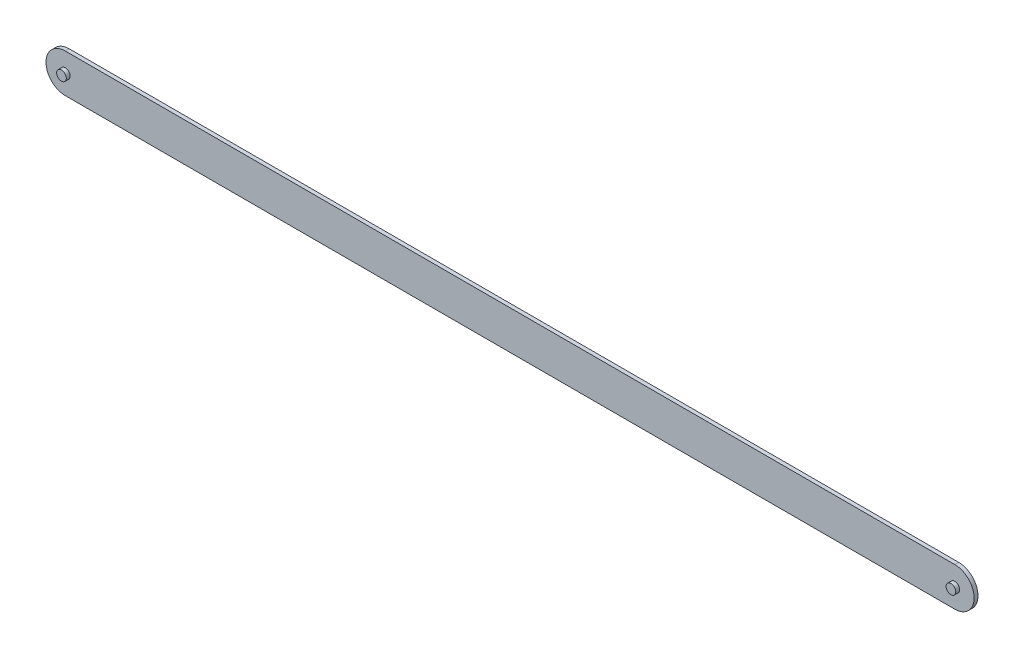
ISO-10303-21;
HEADER;
FILE_DESCRIPTION(('STEP AP214'),'2;1');
FILE_NAME('part.step','',(''),(''),'','','');
FILE_SCHEMA(('AUTOMOTIVE_DESIGN { 1 0 10303 214 1 1 1 1 }'));
ENDSEC;
DATA;
#1=APPLICATION_CONTEXT('core data for automotive mechanical design processes');
#2=APPLICATION_PROTOCOL_DEFINITION('international standard','automotive_design',2000,#1);
#3=PRODUCT_CONTEXT('',#1,'mechanical');
#4=PRODUCT('Part','Part','',(#3));
#5=PRODUCT_RELATED_PRODUCT_CATEGORY('part','',(#4));
#6=PRODUCT_DEFINITION_FORMATION('','',#4);
#7=PRODUCT_DEFINITION_CONTEXT('part definition',#1,'design');
#8=PRODUCT_DEFINITION('design','',#6,#7);
#9=PRODUCT_DEFINITION_SHAPE('','',#8);
#10=(LENGTH_UNIT() NAMED_UNIT(*) SI_UNIT(.MILLI.,.METRE.));
#11=(NAMED_UNIT(*) PLANE_ANGLE_UNIT() SI_UNIT($,.RADIAN.));
#12=(NAMED_UNIT(*) SI_UNIT($,.STERADIAN.) SOLID_ANGLE_UNIT());
#13=UNCERTAINTY_MEASURE_WITH_UNIT(LENGTH_MEASURE(1.E-05),#10,'distance_accuracy_value','');
#14=(GEOMETRIC_REPRESENTATION_CONTEXT(3) GLOBAL_UNCERTAINTY_ASSIGNED_CONTEXT((#13)) GLOBAL_UNIT_ASSIGNED_CONTEXT((#10,
#11,#12)) REPRESENTATION_CONTEXT('',''));
#15=CARTESIAN_POINT('',(0.,0.,0.));
#16=DIRECTION('',(0.,0.,1.));
#17=DIRECTION('',(1.,0.,0.));
#18=AXIS2_PLACEMENT_3D('',#15,#16,#17);
#19=CARTESIAN_POINT('',(584.2,12.7000000000001,2.54));
#20=DIRECTION('',(0.,0.,-1.));
#21=DIRECTION('',(-1.,0.,0.));
#22=AXIS2_PLACEMENT_3D('',#19,#20,#21);
#23=CYLINDRICAL_SURFACE('',#22,12.7);
#24=CARTESIAN_POINT('',(584.2,12.7000000000001,0.));
#25=DIRECTION('',(0.,0.,1.));
#26=DIRECTION('',(1.,0.,0.));
#27=AXIS2_PLACEMENT_3D('',#24,#25,#26);
#28=CIRCLE('',#27,12.7);
#29=CARTESIAN_POINT('',(584.2,0.,0.));
#30=VERTEX_POINT('',#29);
#31=CARTESIAN_POINT('',(584.2,25.4000000000002,0.));
#32=VERTEX_POINT('',#31);
#33=EDGE_CURVE('E109',#30,#32,#28,.T.);
#34=ORIENTED_EDGE('',*,*,#33,.T.);
#35=DIRECTION('',(0.,0.,-1.));
#36=VECTOR('',#35,1.);
#37=CARTESIAN_POINT('',(584.2,25.4000000000002,2.54));
#38=LINE('',#37,#36);
#39=CARTESIAN_POINT('',(584.2,25.4000000000002,2.54));
#40=VERTEX_POINT('',#39);
#41=EDGE_CURVE('E11',#40,#32,#38,.T.);
#42=ORIENTED_EDGE('',*,*,#41,.F.);
#43=CARTESIAN_POINT('',(584.2,12.7000000000001,2.54));
#44=DIRECTION('',(0.,0.,1.));
#45=DIRECTION('',(1.,0.,0.));
#46=AXIS2_PLACEMENT_3D('',#43,#44,#45);
#47=CIRCLE('',#46,12.7);
#48=CARTESIAN_POINT('',(584.2,0.,2.54));
#49=VERTEX_POINT('',#48);
#50=EDGE_CURVE('E80',#49,#40,#47,.T.);
#51=ORIENTED_EDGE('',*,*,#50,.F.);
#52=DIRECTION('',(0.,0.,-1.));
#53=VECTOR('',#52,1.);
#54=CARTESIAN_POINT('',(584.2,0.,2.54));
#55=LINE('',#54,#53);
#56=EDGE_CURVE('E108',#49,#30,#55,.T.);
#57=ORIENTED_EDGE('',*,*,#56,.T.);
#58=EDGE_LOOP('',(#34,#42,#51,#57));
#59=FACE_BOUND('',#58,.T.);
#60=ADVANCED_FACE('F38',(#59),#23,.T.);
#61=CARTESIAN_POINT('',(0.,25.4,2.54));
#62=DIRECTION('',(0.,1.,0.));
#63=DIRECTION('',(-1.,0.,0.));
#64=AXIS2_PLACEMENT_3D('',#61,#62,#63);
#65=PLANE('',#64);
#66=DIRECTION('',(1.,0.,0.));
#67=VECTOR('',#66,1.);
#68=CARTESIAN_POINT('',(0.,25.4,0.));
#69=LINE('',#68,#67);
#70=CARTESIAN_POINT('',(0.,25.4,0.));
#71=VERTEX_POINT('',#70);
#72=EDGE_CURVE('E90',#71,#32,#69,.T.);
#73=ORIENTED_EDGE('',*,*,#72,.F.);
#74=DIRECTION('',(0.,0.,-1.));
#75=VECTOR('',#74,1.);
#76=CARTESIAN_POINT('',(0.,25.4,2.54));
#77=LINE('',#76,#75);
#78=CARTESIAN_POINT('',(0.,25.4,2.54));
#79=VERTEX_POINT('',#78);
#80=EDGE_CURVE('E46',#79,#71,#77,.T.);
#81=ORIENTED_EDGE('',*,*,#80,.F.);
#82=DIRECTION('',(1.,0.,0.));
#83=VECTOR('',#82,1.);
#84=CARTESIAN_POINT('',(0.,25.4,2.54));
#85=LINE('',#84,#83);
#86=EDGE_CURVE('E88',#79,#40,#85,.T.);
#87=ORIENTED_EDGE('',*,*,#86,.T.);
#88=ORIENTED_EDGE('',*,*,#41,.T.);
#89=EDGE_LOOP('',(#73,#81,#87,#88));
#90=FACE_BOUND('',#89,.T.);
#91=ADVANCED_FACE('F87',(#90),#65,.T.);
#92=CARTESIAN_POINT('',(0.,12.7,2.54));
#93=DIRECTION('',(0.,0.,-1.));
#94=DIRECTION('',(-1.,0.,0.));
#95=AXIS2_PLACEMENT_3D('',#92,#93,#94);
#96=CYLINDRICAL_SURFACE('',#95,12.7);
#97=CARTESIAN_POINT('',(0.,12.7,0.));
#98=DIRECTION('',(0.,0.,1.));
#99=DIRECTION('',(1.,0.,0.));
#100=AXIS2_PLACEMENT_3D('',#97,#98,#99);
#101=CIRCLE('',#100,12.7);
#102=CARTESIAN_POINT('',(0.,0.,0.));
#103=VERTEX_POINT('',#102);
#104=EDGE_CURVE('E69',#71,#103,#101,.T.);
#105=ORIENTED_EDGE('',*,*,#104,.T.);
#106=DIRECTION('',(0.,0.,-1.));
#107=VECTOR('',#106,1.);
#108=CARTESIAN_POINT('',(0.,0.,2.54));
#109=LINE('',#108,#107);
#110=CARTESIAN_POINT('',(0.,0.,2.54));
#111=VERTEX_POINT('',#110);
#112=EDGE_CURVE('E91',#111,#103,#109,.T.);
#113=ORIENTED_EDGE('',*,*,#112,.F.);
#114=CARTESIAN_POINT('',(0.,12.7,2.54));
#115=DIRECTION('',(0.,0.,1.));
#116=DIRECTION('',(1.,0.,0.));
#117=AXIS2_PLACEMENT_3D('',#114,#115,#116);
#118=CIRCLE('',#117,12.7);
#119=EDGE_CURVE('E92',#79,#111,#118,.T.);
#120=ORIENTED_EDGE('',*,*,#119,.F.);
#121=ORIENTED_EDGE('',*,*,#80,.T.);
#122=EDGE_LOOP('',(#105,#113,#120,#121));
#123=FACE_BOUND('',#122,.T.);
#124=ADVANCED_FACE('F93',(#123),#96,.T.);
#125=CARTESIAN_POINT('',(0.,0.,2.54));
#126=DIRECTION('',(0.,1.,0.));
#127=DIRECTION('',(0.,0.,1.));
#128=AXIS2_PLACEMENT_3D('',#125,#126,#127);
#129=PLANE('',#128);
#130=DIRECTION('',(1.,0.,0.));
#131=VECTOR('',#130,1.);
#132=CARTESIAN_POINT('',(0.,0.,0.));
#133=LINE('',#132,#131);
#134=EDGE_CURVE('E75',#103,#30,#133,.T.);
#135=ORIENTED_EDGE('',*,*,#134,.T.);
#136=ORIENTED_EDGE('',*,*,#56,.F.);
#137=DIRECTION('',(1.,0.,0.));
#138=VECTOR('',#137,1.);
#139=CARTESIAN_POINT('',(0.,0.,2.54));
#140=LINE('',#139,#138);
#141=EDGE_CURVE('E54',#111,#49,#140,.T.);
#142=ORIENTED_EDGE('',*,*,#141,.F.);
#143=ORIENTED_EDGE('',*,*,#112,.T.);
#144=EDGE_LOOP('',(#135,#136,#142,#143));
#145=FACE_BOUND('',#144,.T.);
#146=ADVANCED_FACE('F117',(#145),#129,.F.);
#147=CARTESIAN_POINT('',(0.,0.,2.54));
#148=DIRECTION('',(0.,0.,1.));
#149=DIRECTION('',(1.,0.,0.));
#150=AXIS2_PLACEMENT_3D('',#147,#148,#149);
#151=PLANE('',#150);
#152=ORIENTED_EDGE('',*,*,#50,.T.);
#153=ORIENTED_EDGE('',*,*,#86,.F.);
#154=ORIENTED_EDGE('',*,*,#119,.T.);
#155=ORIENTED_EDGE('',*,*,#141,.T.);
#156=EDGE_LOOP('',(#152,#153,#154,#155));
#157=FACE_BOUND('',#156,.T.);
#158=CARTESIAN_POINT('',(0.,12.7,2.54));
#159=DIRECTION('',(0.,0.,1.));
#160=DIRECTION('',(1.,0.,0.));
#161=AXIS2_PLACEMENT_3D('',#158,#159,#160);
#162=CIRCLE('',#161,3.175);
#163=CARTESIAN_POINT('',(3.175,12.7,2.54));
#164=VERTEX_POINT('',#163);
#165=EDGE_CURVE('E102',#164,#164,#162,.T.);
#166=ORIENTED_EDGE('',*,*,#165,.F.);
#167=EDGE_LOOP('',(#166));
#168=FACE_BOUND('',#167,.T.);
#169=CARTESIAN_POINT('',(584.2,12.7000000000001,2.54));
#170=DIRECTION('',(0.,0.,1.));
#171=DIRECTION('',(1.,0.,0.));
#172=AXIS2_PLACEMENT_3D('',#169,#170,#171);
#173=CIRCLE('',#172,3.17500000000008);
#174=CARTESIAN_POINT('',(587.375,12.7000000000001,2.54));
#175=VERTEX_POINT('',#174);
#176=EDGE_CURVE('E105',#175,#175,#173,.T.);
#177=ORIENTED_EDGE('',*,*,#176,.F.);
#178=EDGE_LOOP('',(#177));
#179=FACE_BOUND('',#178,.T.);
#180=ADVANCED_FACE('F95',(#157,#168,#179),#151,.T.);
#181=CARTESIAN_POINT('',(0.,0.,0.));
#182=DIRECTION('',(0.,0.,1.));
#183=DIRECTION('',(1.,0.,0.));
#184=AXIS2_PLACEMENT_3D('',#181,#182,#183);
#185=PLANE('',#184);
#186=ORIENTED_EDGE('',*,*,#33,.F.);
#187=ORIENTED_EDGE('',*,*,#134,.F.);
#188=ORIENTED_EDGE('',*,*,#104,.F.);
#189=ORIENTED_EDGE('',*,*,#72,.T.);
#190=EDGE_LOOP('',(#186,#187,#188,#189));
#191=FACE_BOUND('',#190,.T.);
#192=ADVANCED_FACE('F120',(#191),#185,.F.);
#193=CARTESIAN_POINT('',(0.,12.7,5.08));
#194=DIRECTION('',(0.,0.,-1.));
#195=DIRECTION('',(-1.,0.,0.));
#196=AXIS2_PLACEMENT_3D('',#193,#194,#195);
#197=CYLINDRICAL_SURFACE('',#196,3.175);
#198=ORIENTED_EDGE('',*,*,#165,.T.);
#199=EDGE_LOOP('',(#198));
#200=FACE_BOUND('',#199,.T.);
#201=CARTESIAN_POINT('',(0.,12.7,5.08));
#202=DIRECTION('',(0.,0.,1.));
#203=DIRECTION('',(1.,0.,0.));
#204=AXIS2_PLACEMENT_3D('',#201,#202,#203);
#205=CIRCLE('',#204,3.175);
#206=CARTESIAN_POINT('',(3.175,12.7,5.08));
#207=VERTEX_POINT('',#206);
#208=EDGE_CURVE('E112',#207,#207,#205,.T.);
#209=ORIENTED_EDGE('',*,*,#208,.F.);
#210=EDGE_LOOP('',(#209));
#211=FACE_BOUND('',#210,.T.);
#212=ADVANCED_FACE('F135',(#200,#211),#197,.T.);
#213=CARTESIAN_POINT('',(0.,0.,5.08));
#214=DIRECTION('',(0.,0.,1.));
#215=DIRECTION('',(1.,0.,0.));
#216=AXIS2_PLACEMENT_3D('',#213,#214,#215);
#217=PLANE('',#216);
#218=ORIENTED_EDGE('',*,*,#208,.T.);
#219=EDGE_LOOP('',(#218));
#220=FACE_BOUND('',#219,.T.);
#221=ADVANCED_FACE('F140',(#220),#217,.T.);
#222=CARTESIAN_POINT('',(584.2,12.7000000000001,5.08));
#223=DIRECTION('',(0.,0.,-1.));
#224=DIRECTION('',(-1.,0.,0.));
#225=AXIS2_PLACEMENT_3D('',#222,#223,#224);
#226=CYLINDRICAL_SURFACE('',#225,3.17500000000008);
#227=ORIENTED_EDGE('',*,*,#176,.T.);
#228=EDGE_LOOP('',(#227));
#229=FACE_BOUND('',#228,.T.);
#230=CARTESIAN_POINT('',(584.2,12.7000000000001,5.08));
#231=DIRECTION('',(0.,0.,1.));
#232=DIRECTION('',(1.,0.,0.));
#233=AXIS2_PLACEMENT_3D('',#230,#231,#232);
#234=CIRCLE('',#233,3.17500000000008);
#235=CARTESIAN_POINT('',(587.375,12.7000000000001,5.08));
#236=VERTEX_POINT('',#235);
#237=EDGE_CURVE('E156',#236,#236,#234,.T.);
#238=ORIENTED_EDGE('',*,*,#237,.F.);
#239=EDGE_LOOP('',(#238));
#240=FACE_BOUND('',#239,.T.);
#241=ADVANCED_FACE('F144',(#229,#240),#226,.T.);
#242=CARTESIAN_POINT('',(0.,0.,5.08));
#243=DIRECTION('',(0.,0.,1.));
#244=DIRECTION('',(1.,0.,0.));
#245=AXIS2_PLACEMENT_3D('',#242,#243,#244);
#246=PLANE('',#245);
#247=ORIENTED_EDGE('',*,*,#237,.T.);
#248=EDGE_LOOP('',(#247));
#249=FACE_BOUND('',#248,.T.);
#250=ADVANCED_FACE('F148',(#249),#246,.T.);
#251=CLOSED_SHELL('',(#60,#91,#124,#146,#180,#192,#212,#221,#241,#250));
#252=MANIFOLD_SOLID_BREP('B2',#251);
#253=ADVANCED_BREP_SHAPE_REPRESENTATION('',(#18,#252),#14);
#254=SHAPE_DEFINITION_REPRESENTATION(#9,#253);
ENDSEC;
END-ISO-10303-21;
